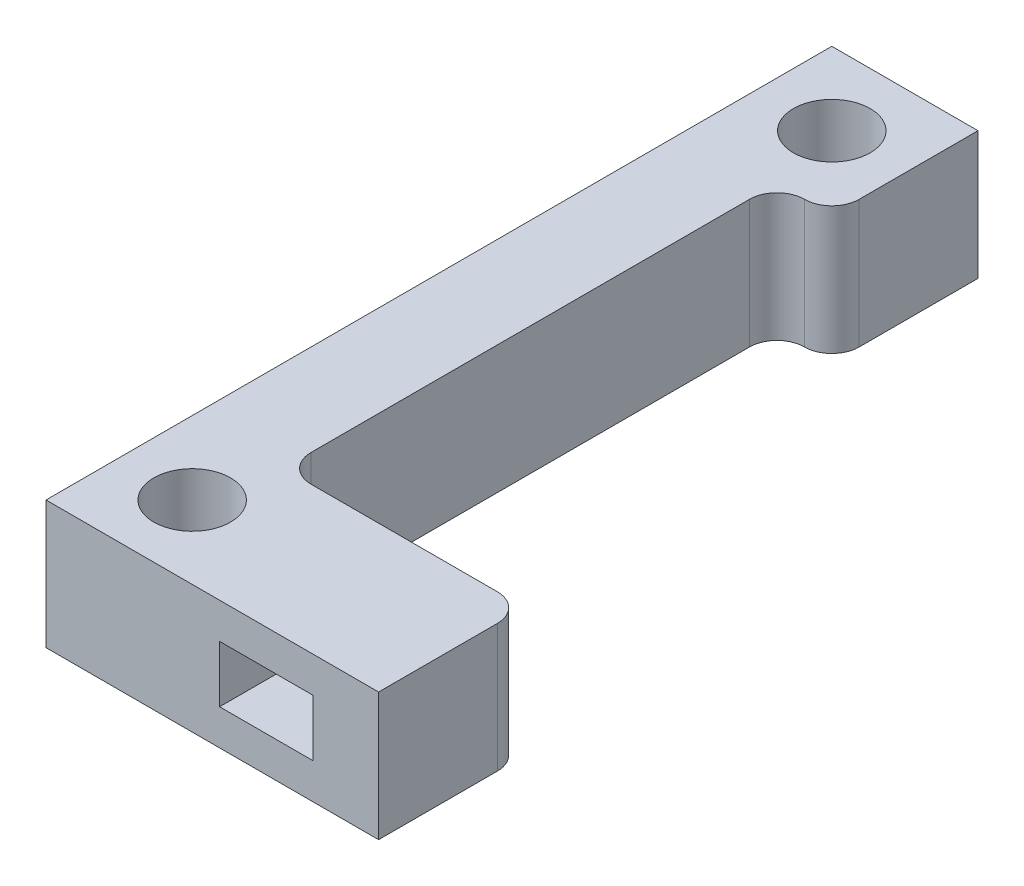
ISO-10303-21;
HEADER;
FILE_DESCRIPTION(('STEP AP214'),'2;1');
FILE_NAME('part.step','',(''),(''),'','','');
FILE_SCHEMA(('AUTOMOTIVE_DESIGN { 1 0 10303 214 1 1 1 1 }'));
ENDSEC;
DATA;
#1=APPLICATION_CONTEXT('core data for automotive mechanical design processes');
#2=APPLICATION_PROTOCOL_DEFINITION('international standard','automotive_design',2000,#1);
#3=PRODUCT_CONTEXT('',#1,'mechanical');
#4=PRODUCT('Part','Part','',(#3));
#5=PRODUCT_RELATED_PRODUCT_CATEGORY('part','',(#4));
#6=PRODUCT_DEFINITION_FORMATION('','',#4);
#7=PRODUCT_DEFINITION_CONTEXT('part definition',#1,'design');
#8=PRODUCT_DEFINITION('design','',#6,#7);
#9=PRODUCT_DEFINITION_SHAPE('','',#8);
#10=(LENGTH_UNIT() NAMED_UNIT(*) SI_UNIT(.MILLI.,.METRE.));
#11=(NAMED_UNIT(*) PLANE_ANGLE_UNIT() SI_UNIT($,.RADIAN.));
#12=(NAMED_UNIT(*) SI_UNIT($,.STERADIAN.) SOLID_ANGLE_UNIT());
#13=UNCERTAINTY_MEASURE_WITH_UNIT(LENGTH_MEASURE(1.E-05),#10,'distance_accuracy_value','');
#14=(GEOMETRIC_REPRESENTATION_CONTEXT(3) GLOBAL_UNCERTAINTY_ASSIGNED_CONTEXT((#13)) GLOBAL_UNIT_ASSIGNED_CONTEXT((#10,
#11,#12)) REPRESENTATION_CONTEXT('',''));
#15=CARTESIAN_POINT('',(0.,0.,0.));
#16=DIRECTION('',(0.,0.,1.));
#17=DIRECTION('',(1.,0.,0.));
#18=AXIS2_PLACEMENT_3D('',#15,#16,#17);
#19=CARTESIAN_POINT('',(0.,7.,-43.));
#20=DIRECTION('',(1.,0.,0.));
#21=DIRECTION('',(0.,0.,-1.));
#22=AXIS2_PLACEMENT_3D('',#19,#20,#21);
#23=PLANE('',#22);
#24=DIRECTION('',(0.,0.,1.));
#25=VECTOR('',#24,1.);
#26=CARTESIAN_POINT('',(0.,0.,-43.));
#27=LINE('',#26,#25);
#28=CARTESIAN_POINT('',(0.,0.,-43.));
#29=VERTEX_POINT('',#28);
#30=CARTESIAN_POINT('',(0.,0.,0.));
#31=VERTEX_POINT('',#30);
#32=EDGE_CURVE('E166',#29,#31,#27,.T.);
#33=ORIENTED_EDGE('',*,*,#32,.T.);
#34=DIRECTION('',(0.,-1.,0.));
#35=VECTOR('',#34,1.);
#36=CARTESIAN_POINT('',(0.,7.,0.));
#37=LINE('',#36,#35);
#38=CARTESIAN_POINT('',(0.,7.,0.));
#39=VERTEX_POINT('',#38);
#40=EDGE_CURVE('E259',#39,#31,#37,.T.);
#41=ORIENTED_EDGE('',*,*,#40,.F.);
#42=DIRECTION('',(0.,0.,1.));
#43=VECTOR('',#42,1.);
#44=CARTESIAN_POINT('',(0.,7.,-43.));
#45=LINE('',#44,#43);
#46=CARTESIAN_POINT('',(0.,7.,-43.));
#47=VERTEX_POINT('',#46);
#48=EDGE_CURVE('E199',#47,#39,#45,.T.);
#49=ORIENTED_EDGE('',*,*,#48,.F.);
#50=DIRECTION('',(0.,-1.,0.));
#51=VECTOR('',#50,1.);
#52=CARTESIAN_POINT('',(0.,7.,-43.));
#53=LINE('',#52,#51);
#54=EDGE_CURVE('E224',#47,#29,#53,.T.);
#55=ORIENTED_EDGE('',*,*,#54,.T.);
#56=EDGE_LOOP('',(#33,#41,#49,#55));
#57=FACE_BOUND('',#56,.T.);
#58=ADVANCED_FACE('F39',(#57),#23,.F.);
#59=CARTESIAN_POINT('',(0.,7.,0.));
#60=DIRECTION('',(0.,0.,-1.));
#61=DIRECTION('',(-1.,0.,0.));
#62=AXIS2_PLACEMENT_3D('',#59,#60,#61);
#63=PLANE('',#62);
#64=DIRECTION('',(1.,0.,0.));
#65=VECTOR('',#64,1.);
#66=CARTESIAN_POINT('',(9.5,1.95,0.));
#67=LINE('',#66,#65);
#68=CARTESIAN_POINT('',(9.5,1.95,0.));
#69=VERTEX_POINT('',#68);
#70=CARTESIAN_POINT('',(14.6,1.95,0.));
#71=VERTEX_POINT('',#70);
#72=EDGE_CURVE('E177',#69,#71,#67,.T.);
#73=ORIENTED_EDGE('',*,*,#72,.F.);
#74=DIRECTION('',(0.,-1.,0.));
#75=VECTOR('',#74,1.);
#76=CARTESIAN_POINT('',(9.5,5.05,0.));
#77=LINE('',#76,#75);
#78=CARTESIAN_POINT('',(9.5,5.05,0.));
#79=VERTEX_POINT('',#78);
#80=EDGE_CURVE('E151',#79,#69,#77,.T.);
#81=ORIENTED_EDGE('',*,*,#80,.F.);
#82=DIRECTION('',(1.,0.,0.));
#83=VECTOR('',#82,1.);
#84=CARTESIAN_POINT('',(9.5,5.05,0.));
#85=LINE('',#84,#83);
#86=CARTESIAN_POINT('',(14.6,5.05,0.));
#87=VERTEX_POINT('',#86);
#88=EDGE_CURVE('E157',#79,#87,#85,.T.);
#89=ORIENTED_EDGE('',*,*,#88,.T.);
#90=DIRECTION('',(0.,-1.,0.));
#91=VECTOR('',#90,1.);
#92=CARTESIAN_POINT('',(14.6,5.05,0.));
#93=LINE('',#92,#91);
#94=EDGE_CURVE('E185',#87,#71,#93,.T.);
#95=ORIENTED_EDGE('',*,*,#94,.T.);
#96=EDGE_LOOP('',(#73,#81,#89,#95));
#97=FACE_BOUND('',#96,.T.);
#98=DIRECTION('',(1.,0.,0.));
#99=VECTOR('',#98,1.);
#100=CARTESIAN_POINT('',(0.,0.,0.));
#101=LINE('',#100,#99);
#102=CARTESIAN_POINT('',(18.2,0.,0.));
#103=VERTEX_POINT('',#102);
#104=EDGE_CURVE('E228',#31,#103,#101,.T.);
#105=ORIENTED_EDGE('',*,*,#104,.T.);
#106=DIRECTION('',(0.,-1.,0.));
#107=VECTOR('',#106,1.);
#108=CARTESIAN_POINT('',(18.2,7.,0.));
#109=LINE('',#108,#107);
#110=CARTESIAN_POINT('',(18.2,7.,0.));
#111=VERTEX_POINT('',#110);
#112=EDGE_CURVE('E255',#111,#103,#109,.T.);
#113=ORIENTED_EDGE('',*,*,#112,.F.);
#114=DIRECTION('',(1.,0.,0.));
#115=VECTOR('',#114,1.);
#116=CARTESIAN_POINT('',(0.,7.,0.));
#117=LINE('',#116,#115);
#118=EDGE_CURVE('E203',#39,#111,#117,.T.);
#119=ORIENTED_EDGE('',*,*,#118,.F.);
#120=ORIENTED_EDGE('',*,*,#40,.T.);
#121=EDGE_LOOP('',(#105,#113,#119,#120));
#122=FACE_BOUND('',#121,.T.);
#123=ADVANCED_FACE('F373',(#97,#122),#63,.F.);
#124=CARTESIAN_POINT('',(18.2,7.,0.));
#125=DIRECTION('',(-1.,0.,0.));
#126=DIRECTION('',(0.,0.,1.));
#127=AXIS2_PLACEMENT_3D('',#124,#125,#126);
#128=PLANE('',#127);
#129=DIRECTION('',(0.,0.,-1.));
#130=VECTOR('',#129,1.);
#131=CARTESIAN_POINT('',(18.2,0.,0.));
#132=LINE('',#131,#130);
#133=CARTESIAN_POINT('',(18.2,0.,-6.5));
#134=VERTEX_POINT('',#133);
#135=EDGE_CURVE('E231',#103,#134,#132,.T.);
#136=ORIENTED_EDGE('',*,*,#135,.T.);
#137=DIRECTION('',(0.,-1.,0.));
#138=VECTOR('',#137,1.);
#139=CARTESIAN_POINT('',(18.2,7.,-6.5));
#140=LINE('',#139,#138);
#141=CARTESIAN_POINT('',(18.2,7.,-6.5));
#142=VERTEX_POINT('',#141);
#143=EDGE_CURVE('E276',#134,#142,#140,.F.);
#144=ORIENTED_EDGE('',*,*,#143,.T.);
#145=DIRECTION('',(0.,0.,-1.));
#146=VECTOR('',#145,1.);
#147=CARTESIAN_POINT('',(18.2,7.,0.));
#148=LINE('',#147,#146);
#149=EDGE_CURVE('E207',#111,#142,#148,.T.);
#150=ORIENTED_EDGE('',*,*,#149,.F.);
#151=ORIENTED_EDGE('',*,*,#112,.T.);
#152=EDGE_LOOP('',(#136,#144,#150,#151));
#153=FACE_BOUND('',#152,.T.);
#154=ADVANCED_FACE('F379',(#153),#128,.F.);
#155=CARTESIAN_POINT('',(5.,7.,-8.));
#156=DIRECTION('',(0.,0.,1.));
#157=DIRECTION('',(1.,0.,0.));
#158=AXIS2_PLACEMENT_3D('',#155,#156,#157);
#159=PLANE('',#158);
#160=DIRECTION('',(-1.,0.,0.));
#161=VECTOR('',#160,1.);
#162=CARTESIAN_POINT('',(9.5,5.05,-8.));
#163=LINE('',#162,#161);
#164=CARTESIAN_POINT('',(14.6,5.05,-8.));
#165=VERTEX_POINT('',#164);
#166=CARTESIAN_POINT('',(9.5,5.05,-8.));
#167=VERTEX_POINT('',#166);
#168=EDGE_CURVE('E172',#165,#167,#163,.T.);
#169=ORIENTED_EDGE('',*,*,#168,.T.);
#170=DIRECTION('',(0.,1.,0.));
#171=VECTOR('',#170,1.);
#172=CARTESIAN_POINT('',(9.5,5.05,-8.));
#173=LINE('',#172,#171);
#174=CARTESIAN_POINT('',(9.5,1.95,-8.));
#175=VERTEX_POINT('',#174);
#176=EDGE_CURVE('E148',#175,#167,#173,.T.);
#177=ORIENTED_EDGE('',*,*,#176,.F.);
#178=DIRECTION('',(-1.,0.,0.));
#179=VECTOR('',#178,1.);
#180=CARTESIAN_POINT('',(9.5,1.95,-8.));
#181=LINE('',#180,#179);
#182=CARTESIAN_POINT('',(14.6,1.95,-8.));
#183=VERTEX_POINT('',#182);
#184=EDGE_CURVE('E161',#183,#175,#181,.T.);
#185=ORIENTED_EDGE('',*,*,#184,.F.);
#186=DIRECTION('',(0.,1.,0.));
#187=VECTOR('',#186,1.);
#188=CARTESIAN_POINT('',(14.6,5.05,-8.));
#189=LINE('',#188,#187);
#190=EDGE_CURVE('E179',#183,#165,#189,.T.);
#191=ORIENTED_EDGE('',*,*,#190,.T.);
#192=EDGE_LOOP('',(#169,#177,#185,#191));
#193=FACE_BOUND('',#192,.T.);
#194=DIRECTION('',(-1.,0.,0.));
#195=VECTOR('',#194,1.);
#196=CARTESIAN_POINT('',(5.,7.,-8.));
#197=LINE('',#196,#195);
#198=CARTESIAN_POINT('',(16.7,7.,-8.));
#199=VERTEX_POINT('',#198);
#200=CARTESIAN_POINT('',(6.5,7.,-8.));
#201=VERTEX_POINT('',#200);
#202=EDGE_CURVE('E211',#199,#201,#197,.T.);
#203=ORIENTED_EDGE('',*,*,#202,.F.);
#204=DIRECTION('',(0.,-1.,0.));
#205=VECTOR('',#204,1.);
#206=CARTESIAN_POINT('',(16.7,7.,-8.));
#207=LINE('',#206,#205);
#208=CARTESIAN_POINT('',(16.7,0.,-8.));
#209=VERTEX_POINT('',#208);
#210=EDGE_CURVE('E266',#199,#209,#207,.T.);
#211=ORIENTED_EDGE('',*,*,#210,.T.);
#212=DIRECTION('',(-1.,0.,0.));
#213=VECTOR('',#212,1.);
#214=CARTESIAN_POINT('',(5.,0.,-8.));
#215=LINE('',#214,#213);
#216=CARTESIAN_POINT('',(6.5,0.,-8.));
#217=VERTEX_POINT('',#216);
#218=EDGE_CURVE('E235',#209,#217,#215,.T.);
#219=ORIENTED_EDGE('',*,*,#218,.T.);
#220=DIRECTION('',(0.,-1.,0.));
#221=VECTOR('',#220,1.);
#222=CARTESIAN_POINT('',(6.5,7.,-8.));
#223=LINE('',#222,#221);
#224=EDGE_CURVE('E263',#217,#201,#223,.F.);
#225=ORIENTED_EDGE('',*,*,#224,.T.);
#226=EDGE_LOOP('',(#203,#211,#219,#225));
#227=FACE_BOUND('',#226,.T.);
#228=ADVANCED_FACE('F169',(#193,#227),#159,.F.);
#229=CARTESIAN_POINT('',(5.,7.,-35.));
#230=DIRECTION('',(-1.,0.,0.));
#231=DIRECTION('',(0.,0.,1.));
#232=AXIS2_PLACEMENT_3D('',#229,#230,#231);
#233=PLANE('',#232);
#234=DIRECTION('',(0.,0.,-1.));
#235=VECTOR('',#234,1.);
#236=CARTESIAN_POINT('',(5.,7.,-35.));
#237=LINE('',#236,#235);
#238=CARTESIAN_POINT('',(5.,7.,-9.5));
#239=VERTEX_POINT('',#238);
#240=CARTESIAN_POINT('',(5.,7.,-33.5));
#241=VERTEX_POINT('',#240);
#242=EDGE_CURVE('E215',#239,#241,#237,.T.);
#243=ORIENTED_EDGE('',*,*,#242,.F.);
#244=DIRECTION('',(0.,-1.,0.));
#245=VECTOR('',#244,1.);
#246=CARTESIAN_POINT('',(5.,0.,-9.5));
#247=LINE('',#246,#245);
#248=CARTESIAN_POINT('',(5.,0.,-9.5));
#249=VERTEX_POINT('',#248);
#250=EDGE_CURVE('E288',#239,#249,#247,.T.);
#251=ORIENTED_EDGE('',*,*,#250,.T.);
#252=DIRECTION('',(0.,0.,-1.));
#253=VECTOR('',#252,1.);
#254=CARTESIAN_POINT('',(5.,0.,-35.));
#255=LINE('',#254,#253);
#256=CARTESIAN_POINT('',(5.,0.,-33.5));
#257=VERTEX_POINT('',#256);
#258=EDGE_CURVE('E239',#249,#257,#255,.T.);
#259=ORIENTED_EDGE('',*,*,#258,.T.);
#260=DIRECTION('',(0.,-1.,0.));
#261=VECTOR('',#260,1.);
#262=CARTESIAN_POINT('',(5.,7.,-33.5));
#263=LINE('',#262,#261);
#264=EDGE_CURVE('E284',#257,#241,#263,.F.);
#265=ORIENTED_EDGE('',*,*,#264,.T.);
#266=EDGE_LOOP('',(#243,#251,#259,#265));
#267=FACE_BOUND('',#266,.T.);
#268=ADVANCED_FACE('F315',(#267),#233,.F.);
#269=CARTESIAN_POINT('',(8.,7.,-43.));
#270=DIRECTION('',(-1.,0.,0.));
#271=DIRECTION('',(0.,0.,1.));
#272=AXIS2_PLACEMENT_3D('',#269,#270,#271);
#273=PLANE('',#272);
#274=DIRECTION('',(0.,0.,-1.));
#275=VECTOR('',#274,1.);
#276=CARTESIAN_POINT('',(8.,7.,-43.));
#277=LINE('',#276,#275);
#278=CARTESIAN_POINT('',(8.,7.,-36.5));
#279=VERTEX_POINT('',#278);
#280=CARTESIAN_POINT('',(8.,7.,-43.));
#281=VERTEX_POINT('',#280);
#282=EDGE_CURVE('E218',#279,#281,#277,.T.);
#283=ORIENTED_EDGE('',*,*,#282,.F.);
#284=DIRECTION('',(0.,-1.,0.));
#285=VECTOR('',#284,1.);
#286=CARTESIAN_POINT('',(8.,7.,-36.5));
#287=LINE('',#286,#285);
#288=CARTESIAN_POINT('',(8.,0.,-36.5));
#289=VERTEX_POINT('',#288);
#290=EDGE_CURVE('E292',#279,#289,#287,.T.);
#291=ORIENTED_EDGE('',*,*,#290,.T.);
#292=DIRECTION('',(0.,0.,-1.));
#293=VECTOR('',#292,1.);
#294=CARTESIAN_POINT('',(8.,0.,-43.));
#295=LINE('',#294,#293);
#296=CARTESIAN_POINT('',(8.,0.,-43.));
#297=VERTEX_POINT('',#296);
#298=EDGE_CURVE('E243',#289,#297,#295,.T.);
#299=ORIENTED_EDGE('',*,*,#298,.T.);
#300=DIRECTION('',(0.,-1.,0.));
#301=VECTOR('',#300,1.);
#302=CARTESIAN_POINT('',(8.,7.,-43.));
#303=LINE('',#302,#301);
#304=EDGE_CURVE('E251',#281,#297,#303,.T.);
#305=ORIENTED_EDGE('',*,*,#304,.F.);
#306=EDGE_LOOP('',(#283,#291,#299,#305));
#307=FACE_BOUND('',#306,.T.);
#308=ADVANCED_FACE('F389',(#307),#273,.F.);
#309=CARTESIAN_POINT('',(8.,7.,-43.));
#310=DIRECTION('',(0.,0.,1.));
#311=DIRECTION('',(1.,0.,0.));
#312=AXIS2_PLACEMENT_3D('',#309,#310,#311);
#313=PLANE('',#312);
#314=DIRECTION('',(-1.,0.,0.));
#315=VECTOR('',#314,1.);
#316=CARTESIAN_POINT('',(8.,0.,-43.));
#317=LINE('',#316,#315);
#318=EDGE_CURVE('E204',#297,#29,#317,.T.);
#319=ORIENTED_EDGE('',*,*,#318,.T.);
#320=ORIENTED_EDGE('',*,*,#54,.F.);
#321=DIRECTION('',(-1.,0.,0.));
#322=VECTOR('',#321,1.);
#323=CARTESIAN_POINT('',(8.,7.,-43.));
#324=LINE('',#323,#322);
#325=EDGE_CURVE('E221',#281,#47,#324,.T.);
#326=ORIENTED_EDGE('',*,*,#325,.F.);
#327=ORIENTED_EDGE('',*,*,#304,.T.);
#328=EDGE_LOOP('',(#319,#320,#326,#327));
#329=FACE_BOUND('',#328,.T.);
#330=ADVANCED_FACE('F348',(#329),#313,.F.);
#331=CARTESIAN_POINT('',(0.,7.,0.));
#332=DIRECTION('',(0.,1.,0.));
#333=DIRECTION('',(0.,0.,1.));
#334=AXIS2_PLACEMENT_3D('',#331,#332,#333);
#335=PLANE('',#334);
#336=CARTESIAN_POINT('',(4.,7.,-39.));
#337=DIRECTION('',(0.,1.,0.));
#338=DIRECTION('',(0.,0.,1.));
#339=AXIS2_PLACEMENT_3D('',#336,#337,#338);
#340=CIRCLE('',#339,2.1);
#341=CARTESIAN_POINT('',(4.,7.,-36.9));
#342=VERTEX_POINT('',#341);
#343=EDGE_CURVE('E329',#342,#342,#340,.T.);
#344=ORIENTED_EDGE('',*,*,#343,.F.);
#345=EDGE_LOOP('',(#344));
#346=FACE_BOUND('',#345,.T.);
#347=CARTESIAN_POINT('',(4.,7.,-3.99999999999999));
#348=DIRECTION('',(0.,1.,0.));
#349=DIRECTION('',(0.,0.,1.));
#350=AXIS2_PLACEMENT_3D('',#347,#348,#349);
#351=CIRCLE('',#350,2.1);
#352=CARTESIAN_POINT('',(4.,7.,-1.89999999999999));
#353=VERTEX_POINT('',#352);
#354=EDGE_CURVE('E323',#353,#353,#351,.T.);
#355=ORIENTED_EDGE('',*,*,#354,.F.);
#356=EDGE_LOOP('',(#355));
#357=FACE_BOUND('',#356,.T.);
#358=ORIENTED_EDGE('',*,*,#149,.T.);
#359=CARTESIAN_POINT('',(16.7,7.,-6.5));
#360=DIRECTION('',(0.,1.,0.));
#361=DIRECTION('',(0.,0.,1.));
#362=AXIS2_PLACEMENT_3D('',#359,#360,#361);
#363=CIRCLE('',#362,1.5);
#364=EDGE_CURVE('E281',#142,#199,#363,.T.);
#365=ORIENTED_EDGE('',*,*,#364,.T.);
#366=ORIENTED_EDGE('',*,*,#202,.T.);
#367=CARTESIAN_POINT('',(6.5,7.,-9.5));
#368=DIRECTION('',(0.,1.,0.));
#369=DIRECTION('',(0.,0.,1.));
#370=AXIS2_PLACEMENT_3D('',#367,#368,#369);
#371=CIRCLE('',#370,1.5);
#372=EDGE_CURVE('E298',#201,#239,#371,.F.);
#373=ORIENTED_EDGE('',*,*,#372,.T.);
#374=ORIENTED_EDGE('',*,*,#242,.T.);
#375=CARTESIAN_POINT('',(6.5,7.,-33.5));
#376=DIRECTION('',(0.,1.,0.));
#377=DIRECTION('',(0.,0.,1.));
#378=AXIS2_PLACEMENT_3D('',#375,#376,#377);
#379=CIRCLE('',#378,1.5);
#380=CARTESIAN_POINT('',(6.5,7.,-35.));
#381=VERTEX_POINT('',#380);
#382=EDGE_CURVE('E11',#241,#381,#379,.F.);
#383=ORIENTED_EDGE('',*,*,#382,.T.);
#384=CARTESIAN_POINT('',(6.5,7.,-36.5));
#385=DIRECTION('',(0.,1.,0.));
#386=DIRECTION('',(0.,0.,1.));
#387=AXIS2_PLACEMENT_3D('',#384,#385,#386);
#388=CIRCLE('',#387,1.5);
#389=EDGE_CURVE('E55',#381,#279,#388,.T.);
#390=ORIENTED_EDGE('',*,*,#389,.T.);
#391=ORIENTED_EDGE('',*,*,#282,.T.);
#392=ORIENTED_EDGE('',*,*,#325,.T.);
#393=ORIENTED_EDGE('',*,*,#48,.T.);
#394=ORIENTED_EDGE('',*,*,#118,.T.);
#395=EDGE_LOOP('',(#358,#365,#366,#373,#374,#383,#390,#391,#392,#393,#394));
#396=FACE_BOUND('',#395,.T.);
#397=ADVANCED_FACE('F345',(#346,#357,#396),#335,.T.);
#398=CARTESIAN_POINT('',(0.,0.,0.));
#399=DIRECTION('',(0.,1.,0.));
#400=DIRECTION('',(0.,0.,1.));
#401=AXIS2_PLACEMENT_3D('',#398,#399,#400);
#402=PLANE('',#401);
#403=CARTESIAN_POINT('',(4.,0.,-39.));
#404=DIRECTION('',(0.,1.,0.));
#405=DIRECTION('',(0.,0.,1.));
#406=AXIS2_PLACEMENT_3D('',#403,#404,#405);
#407=CIRCLE('',#406,2.1);
#408=CARTESIAN_POINT('',(4.,0.,-36.9));
#409=VERTEX_POINT('',#408);
#410=EDGE_CURVE('E332',#409,#409,#407,.F.);
#411=ORIENTED_EDGE('',*,*,#410,.F.);
#412=EDGE_LOOP('',(#411));
#413=FACE_BOUND('',#412,.T.);
#414=CARTESIAN_POINT('',(4.,0.,-3.99999999999999));
#415=DIRECTION('',(0.,1.,0.));
#416=DIRECTION('',(0.,0.,1.));
#417=AXIS2_PLACEMENT_3D('',#414,#415,#416);
#418=CIRCLE('',#417,2.1);
#419=CARTESIAN_POINT('',(4.,0.,-1.89999999999999));
#420=VERTEX_POINT('',#419);
#421=EDGE_CURVE('E320',#420,#420,#418,.F.);
#422=ORIENTED_EDGE('',*,*,#421,.F.);
#423=EDGE_LOOP('',(#422));
#424=FACE_BOUND('',#423,.T.);
#425=ORIENTED_EDGE('',*,*,#218,.F.);
#426=CARTESIAN_POINT('',(16.7,0.,-6.5));
#427=DIRECTION('',(0.,1.,0.));
#428=DIRECTION('',(0.,0.,1.));
#429=AXIS2_PLACEMENT_3D('',#426,#427,#428);
#430=CIRCLE('',#429,1.5);
#431=EDGE_CURVE('E273',#209,#134,#430,.F.);
#432=ORIENTED_EDGE('',*,*,#431,.T.);
#433=ORIENTED_EDGE('',*,*,#135,.F.);
#434=ORIENTED_EDGE('',*,*,#104,.F.);
#435=ORIENTED_EDGE('',*,*,#32,.F.);
#436=ORIENTED_EDGE('',*,*,#318,.F.);
#437=ORIENTED_EDGE('',*,*,#298,.F.);
#438=CARTESIAN_POINT('',(6.5,0.,-36.5));
#439=DIRECTION('',(0.,1.,0.));
#440=DIRECTION('',(0.,0.,1.));
#441=AXIS2_PLACEMENT_3D('',#438,#439,#440);
#442=CIRCLE('',#441,1.5);
#443=CARTESIAN_POINT('',(6.5,0.,-35.));
#444=VERTEX_POINT('',#443);
#445=EDGE_CURVE('E270',#289,#444,#442,.F.);
#446=ORIENTED_EDGE('',*,*,#445,.T.);
#447=CARTESIAN_POINT('',(6.5,0.,-33.5));
#448=DIRECTION('',(0.,1.,0.));
#449=DIRECTION('',(0.,0.,1.));
#450=AXIS2_PLACEMENT_3D('',#447,#448,#449);
#451=CIRCLE('',#450,1.5);
#452=EDGE_CURVE('E49',#444,#257,#451,.T.);
#453=ORIENTED_EDGE('',*,*,#452,.T.);
#454=ORIENTED_EDGE('',*,*,#258,.F.);
#455=CARTESIAN_POINT('',(6.5,0.,-9.5));
#456=DIRECTION('',(0.,1.,0.));
#457=DIRECTION('',(0.,0.,1.));
#458=AXIS2_PLACEMENT_3D('',#455,#456,#457);
#459=CIRCLE('',#458,1.5);
#460=EDGE_CURVE('E295',#249,#217,#459,.T.);
#461=ORIENTED_EDGE('',*,*,#460,.T.);
#462=EDGE_LOOP('',(#425,#432,#433,#434,#435,#436,#437,#446,#453,#454,#461));
#463=FACE_BOUND('',#462,.T.);
#464=ADVANCED_FACE('F306',(#413,#424,#463),#402,.F.);
#465=CARTESIAN_POINT('',(9.5,5.05,-43.001));
#466=DIRECTION('',(-1.,0.,0.));
#467=DIRECTION('',(0.,0.,1.));
#468=AXIS2_PLACEMENT_3D('',#465,#466,#467);
#469=PLANE('',#468);
#470=ORIENTED_EDGE('',*,*,#176,.T.);
#471=DIRECTION('',(0.,0.,1.));
#472=VECTOR('',#471,1.);
#473=CARTESIAN_POINT('',(9.5,5.05,-43.001));
#474=LINE('',#473,#472);
#475=EDGE_CURVE('E167',#167,#79,#474,.T.);
#476=ORIENTED_EDGE('',*,*,#475,.T.);
#477=ORIENTED_EDGE('',*,*,#80,.T.);
#478=DIRECTION('',(0.,0.,1.));
#479=VECTOR('',#478,1.);
#480=CARTESIAN_POINT('',(9.5,1.95,-43.001));
#481=LINE('',#480,#479);
#482=EDGE_CURVE('E144',#175,#69,#481,.T.);
#483=ORIENTED_EDGE('',*,*,#482,.F.);
#484=EDGE_LOOP('',(#470,#476,#477,#483));
#485=FACE_BOUND('',#484,.T.);
#486=ADVANCED_FACE('F146',(#485),#469,.F.);
#487=CARTESIAN_POINT('',(9.5,5.05,-43.001));
#488=DIRECTION('',(0.,-1.,0.));
#489=DIRECTION('',(0.,0.,-1.));
#490=AXIS2_PLACEMENT_3D('',#487,#488,#489);
#491=PLANE('',#490);
#492=DIRECTION('',(0.,0.,1.));
#493=VECTOR('',#492,1.);
#494=CARTESIAN_POINT('',(14.6,5.05,-43.001));
#495=LINE('',#494,#493);
#496=EDGE_CURVE('E194',#165,#87,#495,.T.);
#497=ORIENTED_EDGE('',*,*,#496,.T.);
#498=ORIENTED_EDGE('',*,*,#88,.F.);
#499=ORIENTED_EDGE('',*,*,#475,.F.);
#500=ORIENTED_EDGE('',*,*,#168,.F.);
#501=EDGE_LOOP('',(#497,#498,#499,#500));
#502=FACE_BOUND('',#501,.T.);
#503=ADVANCED_FACE('F401',(#502),#491,.T.);
#504=CARTESIAN_POINT('',(14.6,5.05,-43.001));
#505=DIRECTION('',(-1.,0.,0.));
#506=DIRECTION('',(0.,0.,1.));
#507=AXIS2_PLACEMENT_3D('',#504,#505,#506);
#508=PLANE('',#507);
#509=DIRECTION('',(0.,0.,1.));
#510=VECTOR('',#509,1.);
#511=CARTESIAN_POINT('',(14.6,1.95,-43.001));
#512=LINE('',#511,#510);
#513=EDGE_CURVE('E156',#183,#71,#512,.T.);
#514=ORIENTED_EDGE('',*,*,#513,.T.);
#515=ORIENTED_EDGE('',*,*,#94,.F.);
#516=ORIENTED_EDGE('',*,*,#496,.F.);
#517=ORIENTED_EDGE('',*,*,#190,.F.);
#518=EDGE_LOOP('',(#514,#515,#516,#517));
#519=FACE_BOUND('',#518,.T.);
#520=ADVANCED_FACE('F405',(#519),#508,.T.);
#521=CARTESIAN_POINT('',(9.5,1.95,-43.001));
#522=DIRECTION('',(0.,-1.,0.));
#523=DIRECTION('',(0.,0.,-1.));
#524=AXIS2_PLACEMENT_3D('',#521,#522,#523);
#525=PLANE('',#524);
#526=ORIENTED_EDGE('',*,*,#184,.T.);
#527=ORIENTED_EDGE('',*,*,#482,.T.);
#528=ORIENTED_EDGE('',*,*,#72,.T.);
#529=ORIENTED_EDGE('',*,*,#513,.F.);
#530=EDGE_LOOP('',(#526,#527,#528,#529));
#531=FACE_BOUND('',#530,.T.);
#532=ADVANCED_FACE('F162',(#531),#525,.F.);
#533=CARTESIAN_POINT('',(4.,-0.00100000000000013,-3.99999999999999));
#534=DIRECTION('',(0.,1.,0.));
#535=DIRECTION('',(0.,0.,1.));
#536=AXIS2_PLACEMENT_3D('',#533,#534,#535);
#537=CYLINDRICAL_SURFACE('',#536,2.1);
#538=ORIENTED_EDGE('',*,*,#354,.T.);
#539=EDGE_LOOP('',(#538));
#540=FACE_BOUND('',#539,.T.);
#541=ORIENTED_EDGE('',*,*,#421,.T.);
#542=EDGE_LOOP('',(#541));
#543=FACE_BOUND('',#542,.T.);
#544=ADVANCED_FACE('F404',(#540,#543),#537,.F.);
#545=CARTESIAN_POINT('',(4.,-0.00100000000000013,-39.));
#546=DIRECTION('',(0.,1.,0.));
#547=DIRECTION('',(0.,0.,1.));
#548=AXIS2_PLACEMENT_3D('',#545,#546,#547);
#549=CYLINDRICAL_SURFACE('',#548,2.1);
#550=ORIENTED_EDGE('',*,*,#343,.T.);
#551=EDGE_LOOP('',(#550));
#552=FACE_BOUND('',#551,.T.);
#553=ORIENTED_EDGE('',*,*,#410,.T.);
#554=EDGE_LOOP('',(#553));
#555=FACE_BOUND('',#554,.T.);
#556=ADVANCED_FACE('F343',(#552,#555),#549,.F.);
#557=CARTESIAN_POINT('',(16.7,7.,-6.5));
#558=DIRECTION('',(0.,-1.,0.));
#559=DIRECTION('',(0.,0.,-1.));
#560=AXIS2_PLACEMENT_3D('',#557,#558,#559);
#561=CYLINDRICAL_SURFACE('',#560,1.5);
#562=ORIENTED_EDGE('',*,*,#364,.F.);
#563=ORIENTED_EDGE('',*,*,#143,.F.);
#564=ORIENTED_EDGE('',*,*,#431,.F.);
#565=ORIENTED_EDGE('',*,*,#210,.F.);
#566=EDGE_LOOP('',(#562,#563,#564,#565));
#567=FACE_BOUND('',#566,.T.);
#568=ADVANCED_FACE('F359',(#567),#561,.T.);
#569=CARTESIAN_POINT('',(6.5,7.,-9.5));
#570=DIRECTION('',(0.,1.,0.));
#571=DIRECTION('',(0.,0.,1.));
#572=AXIS2_PLACEMENT_3D('',#569,#570,#571);
#573=CYLINDRICAL_SURFACE('',#572,1.5);
#574=ORIENTED_EDGE('',*,*,#372,.F.);
#575=ORIENTED_EDGE('',*,*,#224,.F.);
#576=ORIENTED_EDGE('',*,*,#460,.F.);
#577=ORIENTED_EDGE('',*,*,#250,.F.);
#578=EDGE_LOOP('',(#574,#575,#576,#577));
#579=FACE_BOUND('',#578,.T.);
#580=ADVANCED_FACE('F364',(#579),#573,.F.);
#581=CARTESIAN_POINT('',(6.5,7.,-36.5));
#582=DIRECTION('',(0.,-1.,0.));
#583=DIRECTION('',(0.,0.,-1.));
#584=AXIS2_PLACEMENT_3D('',#581,#582,#583);
#585=CYLINDRICAL_SURFACE('',#584,1.5);
#586=ORIENTED_EDGE('',*,*,#290,.F.);
#587=ORIENTED_EDGE('',*,*,#389,.F.);
#588=DIRECTION('',(0.,-1.,0.));
#589=VECTOR('',#588,1.);
#590=CARTESIAN_POINT('',(6.5,7.,-35.));
#591=LINE('',#590,#589);
#592=EDGE_CURVE('E43',#444,#381,#591,.F.);
#593=ORIENTED_EDGE('',*,*,#592,.F.);
#594=ORIENTED_EDGE('',*,*,#445,.F.);
#595=EDGE_LOOP('',(#586,#587,#593,#594));
#596=FACE_BOUND('',#595,.T.);
#597=ADVANCED_FACE('F41',(#596),#585,.T.);
#598=CARTESIAN_POINT('',(6.5,7.,-33.5));
#599=DIRECTION('',(0.,1.,0.));
#600=DIRECTION('',(0.,0.,1.));
#601=AXIS2_PLACEMENT_3D('',#598,#599,#600);
#602=CYLINDRICAL_SURFACE('',#601,1.5);
#603=ORIENTED_EDGE('',*,*,#382,.F.);
#604=ORIENTED_EDGE('',*,*,#264,.F.);
#605=ORIENTED_EDGE('',*,*,#452,.F.);
#606=ORIENTED_EDGE('',*,*,#592,.T.);
#607=EDGE_LOOP('',(#603,#604,#605,#606));
#608=FACE_BOUND('',#607,.T.);
#609=ADVANCED_FACE('F317',(#608),#602,.F.);
#610=CLOSED_SHELL('',(#58,#123,#154,#228,#268,#308,#330,#397,#464,#486,#503,#520,#532,#544,#556,
#568,#580,#597,#609));
#611=MANIFOLD_SOLID_BREP('B2',#610);
#612=ADVANCED_BREP_SHAPE_REPRESENTATION('',(#18,#611),#14);
#613=SHAPE_DEFINITION_REPRESENTATION(#9,#612);
ENDSEC;
END-ISO-10303-21;
